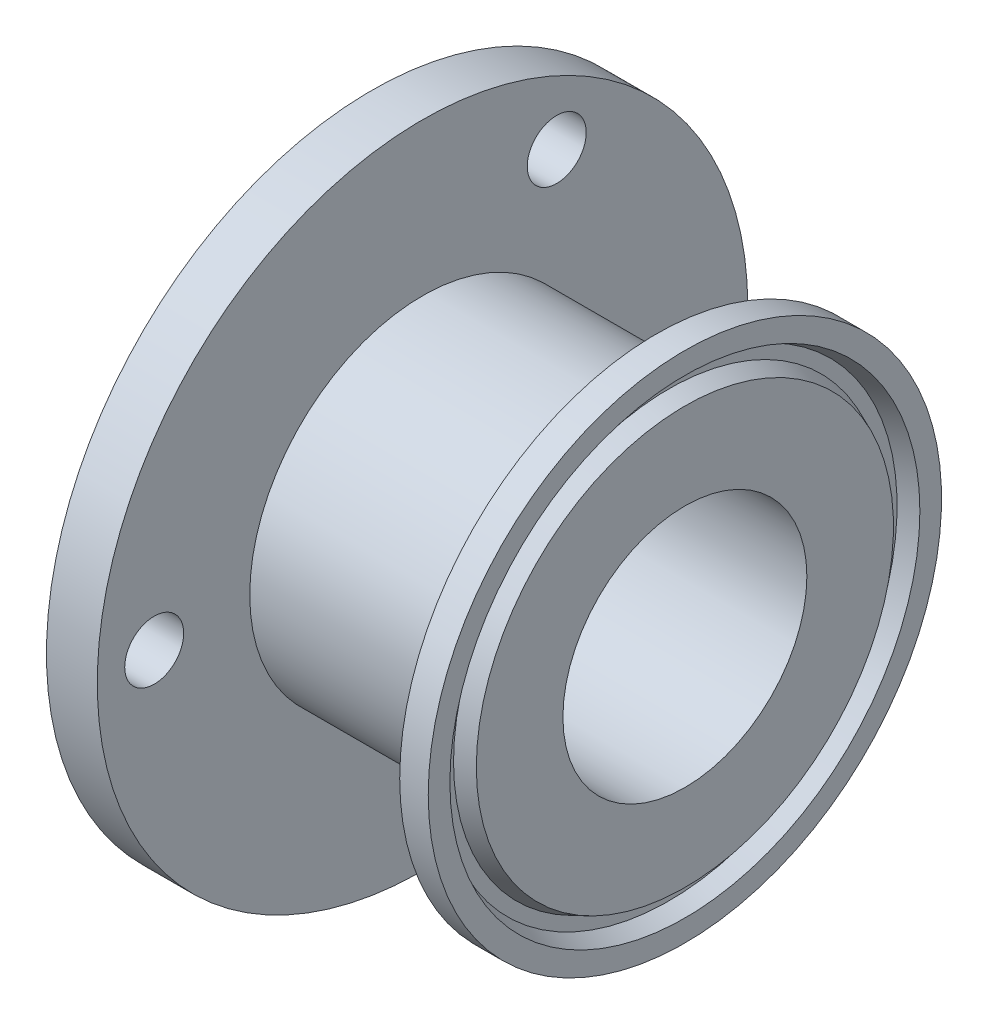
ISO-10303-21;
HEADER;
FILE_DESCRIPTION(('STEP AP214'),'2;1');
FILE_NAME('part.step','',(''),(''),'','','');
FILE_SCHEMA(('AUTOMOTIVE_DESIGN { 1 0 10303 214 1 1 1 1 }'));
ENDSEC;
DATA;
#1=APPLICATION_CONTEXT('core data for automotive mechanical design processes');
#2=APPLICATION_PROTOCOL_DEFINITION('international standard','automotive_design',2000,#1);
#3=PRODUCT_CONTEXT('',#1,'mechanical');
#4=PRODUCT('Part','Part','',(#3));
#5=PRODUCT_RELATED_PRODUCT_CATEGORY('part','',(#4));
#6=PRODUCT_DEFINITION_FORMATION('','',#4);
#7=PRODUCT_DEFINITION_CONTEXT('part definition',#1,'design');
#8=PRODUCT_DEFINITION('design','',#6,#7);
#9=PRODUCT_DEFINITION_SHAPE('','',#8);
#10=(LENGTH_UNIT() NAMED_UNIT(*) SI_UNIT(.MILLI.,.METRE.));
#11=(NAMED_UNIT(*) PLANE_ANGLE_UNIT() SI_UNIT($,.RADIAN.));
#12=(NAMED_UNIT(*) SI_UNIT($,.STERADIAN.) SOLID_ANGLE_UNIT());
#13=UNCERTAINTY_MEASURE_WITH_UNIT(LENGTH_MEASURE(1.E-05),#10,'distance_accuracy_value','');
#14=(GEOMETRIC_REPRESENTATION_CONTEXT(3) GLOBAL_UNCERTAINTY_ASSIGNED_CONTEXT((#13)) GLOBAL_UNIT_ASSIGNED_CONTEXT((#10,
#11,#12)) REPRESENTATION_CONTEXT('',''));
#15=CARTESIAN_POINT('',(0.,0.,0.));
#16=DIRECTION('',(0.,0.,1.));
#17=DIRECTION('',(1.,0.,0.));
#18=AXIS2_PLACEMENT_3D('',#15,#16,#17);
#19=CARTESIAN_POINT('',(-10.4047272163481,34.,0.));
#20=DIRECTION('',(-1.,0.,0.));
#21=DIRECTION('',(0.,0.,1.));
#22=AXIS2_PLACEMENT_3D('',#19,#20,#21);
#23=PLANE('',#22);
#24=CARTESIAN_POINT('',(-10.4047272163481,-22.8630706604579,-13.1999999990536));
#25=DIRECTION('',(-1.,0.,0.));
#26=DIRECTION('',(0.,0.,1.));
#27=AXIS2_PLACEMENT_3D('',#24,#25,#26);
#28=CIRCLE('',#27,2.9);
#29=CARTESIAN_POINT('',(-10.4047272163481,-22.8630706604579,-10.2999999990536));
#30=VERTEX_POINT('',#29);
#31=EDGE_CURVE('E90',#30,#30,#28,.F.);
#32=ORIENTED_EDGE('',*,*,#31,.F.);
#33=EDGE_LOOP('',(#32));
#34=FACE_BOUND('',#33,.T.);
#35=CARTESIAN_POINT('',(-10.4047272163481,22.8630706593604,-13.2000000009425));
#36=DIRECTION('',(-1.,0.,0.));
#37=DIRECTION('',(0.,0.,1.));
#38=AXIS2_PLACEMENT_3D('',#35,#36,#37);
#39=CIRCLE('',#38,2.9);
#40=CARTESIAN_POINT('',(-10.4047272163481,22.8630706593604,-10.3000000009425));
#41=VERTEX_POINT('',#40);
#42=EDGE_CURVE('E84',#41,#41,#39,.F.);
#43=ORIENTED_EDGE('',*,*,#42,.F.);
#44=EDGE_LOOP('',(#43));
#45=FACE_BOUND('',#44,.T.);
#46=CARTESIAN_POINT('',(-10.4047272163481,0.,0.));
#47=DIRECTION('',(-1.,0.,0.));
#48=DIRECTION('',(0.,0.,1.));
#49=AXIS2_PLACEMENT_3D('',#46,#47,#48);
#50=CIRCLE('',#49,17.);
#51=CARTESIAN_POINT('',(-10.4047272163481,0.,17.));
#52=VERTEX_POINT('',#51);
#53=EDGE_CURVE('E74',#52,#52,#50,.T.);
#54=ORIENTED_EDGE('',*,*,#53,.T.);
#55=EDGE_LOOP('',(#54));
#56=FACE_BOUND('',#55,.T.);
#57=CARTESIAN_POINT('',(-10.4047272163481,1.08713038571295E-09,26.4000000000021));
#58=DIRECTION('',(-1.,0.,0.));
#59=DIRECTION('',(0.,0.,1.));
#60=AXIS2_PLACEMENT_3D('',#57,#58,#59);
#61=CIRCLE('',#60,2.9);
#62=CARTESIAN_POINT('',(-10.4047272163481,1.08713038571295E-09,29.3000000000021));
#63=VERTEX_POINT('',#62);
#64=EDGE_CURVE('E80',#63,#63,#61,.F.);
#65=ORIENTED_EDGE('',*,*,#64,.F.);
#66=EDGE_LOOP('',(#65));
#67=FACE_BOUND('',#66,.T.);
#68=CARTESIAN_POINT('',(-10.4047272163481,0.,0.));
#69=DIRECTION('',(1.,0.,0.));
#70=DIRECTION('',(0.,0.,-1.));
#71=AXIS2_PLACEMENT_3D('',#68,#69,#70);
#72=CIRCLE('',#71,32.);
#73=CARTESIAN_POINT('',(-10.4047272163481,0.,-32.));
#74=VERTEX_POINT('',#73);
#75=EDGE_CURVE('E99',#74,#74,#72,.T.);
#76=ORIENTED_EDGE('',*,*,#75,.T.);
#77=EDGE_LOOP('',(#76));
#78=FACE_BOUND('',#77,.T.);
#79=ADVANCED_FACE('F39',(#34,#45,#56,#67,#78),#23,.F.);
#80=CARTESIAN_POINT('',(-15.4047272163481,12.,0.));
#81=DIRECTION('',(1.,0.,0.));
#82=DIRECTION('',(0.,0.,-1.));
#83=AXIS2_PLACEMENT_3D('',#80,#81,#82);
#84=PLANE('',#83);
#85=CARTESIAN_POINT('',(-15.4047272163481,0.,0.));
#86=DIRECTION('',(-1.,0.,0.));
#87=DIRECTION('',(0.,0.,1.));
#88=AXIS2_PLACEMENT_3D('',#85,#86,#87);
#89=CIRCLE('',#88,12.);
#90=CARTESIAN_POINT('',(-15.4047272163481,0.,12.));
#91=VERTEX_POINT('',#90);
#92=EDGE_CURVE('E77',#91,#91,#89,.T.);
#93=ORIENTED_EDGE('',*,*,#92,.F.);
#94=EDGE_LOOP('',(#93));
#95=FACE_BOUND('',#94,.T.);
#96=CARTESIAN_POINT('',(-15.4047272163481,1.08713038571295E-09,26.4000000000021));
#97=DIRECTION('',(-1.,0.,0.));
#98=DIRECTION('',(0.,0.,1.));
#99=AXIS2_PLACEMENT_3D('',#96,#97,#98);
#100=CIRCLE('',#99,2.9);
#101=CARTESIAN_POINT('',(-15.4047272163481,1.08713038571295E-09,29.3000000000021));
#102=VERTEX_POINT('',#101);
#103=EDGE_CURVE('E81',#102,#102,#100,.T.);
#104=ORIENTED_EDGE('',*,*,#103,.F.);
#105=EDGE_LOOP('',(#104));
#106=FACE_BOUND('',#105,.T.);
#107=CARTESIAN_POINT('',(-15.4047272163481,22.8630706593604,-13.2000000009425));
#108=DIRECTION('',(-1.,0.,0.));
#109=DIRECTION('',(0.,0.,1.));
#110=AXIS2_PLACEMENT_3D('',#107,#108,#109);
#111=CIRCLE('',#110,2.9);
#112=CARTESIAN_POINT('',(-15.4047272163481,22.8630706593604,-10.3000000009425));
#113=VERTEX_POINT('',#112);
#114=EDGE_CURVE('E87',#113,#113,#111,.T.);
#115=ORIENTED_EDGE('',*,*,#114,.F.);
#116=EDGE_LOOP('',(#115));
#117=FACE_BOUND('',#116,.T.);
#118=CARTESIAN_POINT('',(-15.4047272163481,-22.8630706604579,-13.1999999990536));
#119=DIRECTION('',(-1.,0.,0.));
#120=DIRECTION('',(0.,0.,1.));
#121=AXIS2_PLACEMENT_3D('',#118,#119,#120);
#122=CIRCLE('',#121,2.9);
#123=CARTESIAN_POINT('',(-15.4047272163481,-22.8630706604579,-10.2999999990536));
#124=VERTEX_POINT('',#123);
#125=EDGE_CURVE('E93',#124,#124,#122,.T.);
#126=ORIENTED_EDGE('',*,*,#125,.F.);
#127=EDGE_LOOP('',(#126));
#128=FACE_BOUND('',#127,.T.);
#129=CARTESIAN_POINT('',(-15.4047272163481,0.,0.));
#130=DIRECTION('',(1.,0.,0.));
#131=DIRECTION('',(0.,0.,-1.));
#132=AXIS2_PLACEMENT_3D('',#129,#130,#131);
#133=CIRCLE('',#132,32.);
#134=CARTESIAN_POINT('',(-15.4047272163481,0.,-32.));
#135=VERTEX_POINT('',#134);
#136=EDGE_CURVE('E96',#135,#135,#133,.T.);
#137=ORIENTED_EDGE('',*,*,#136,.F.);
#138=EDGE_LOOP('',(#137));
#139=FACE_BOUND('',#138,.T.);
#140=ADVANCED_FACE('F108',(#95,#106,#117,#128,#139),#84,.F.);
#141=CARTESIAN_POINT('',(0.,0.,0.));
#142=DIRECTION('',(-1.,0.,0.));
#143=DIRECTION('',(0.,0.,1.));
#144=AXIS2_PLACEMENT_3D('',#141,#142,#143);
#145=CYLINDRICAL_SURFACE('',#144,12.);
#146=CARTESIAN_POINT('',(15.4047272163481,0.,0.));
#147=DIRECTION('',(-1.,0.,0.));
#148=DIRECTION('',(0.,0.,1.));
#149=AXIS2_PLACEMENT_3D('',#146,#147,#148);
#150=CIRCLE('',#149,12.);
#151=CARTESIAN_POINT('',(15.4047272163481,0.,12.));
#152=VERTEX_POINT('',#151);
#153=EDGE_CURVE('E11',#152,#152,#150,.T.);
#154=ORIENTED_EDGE('',*,*,#153,.F.);
#155=EDGE_LOOP('',(#154));
#156=FACE_BOUND('',#155,.T.);
#157=ORIENTED_EDGE('',*,*,#92,.T.);
#158=EDGE_LOOP('',(#157));
#159=FACE_BOUND('',#158,.T.);
#160=ADVANCED_FACE('F41',(#156,#159),#145,.F.);
#161=CARTESIAN_POINT('',(15.4047272163481,20.5186,0.));
#162=DIRECTION('',(-1.,0.,0.));
#163=DIRECTION('',(0.,0.,1.));
#164=AXIS2_PLACEMENT_3D('',#161,#162,#163);
#165=PLANE('',#164);
#166=CARTESIAN_POINT('',(15.4047272163481,0.,0.));
#167=DIRECTION('',(-1.,0.,0.));
#168=DIRECTION('',(0.,0.,1.));
#169=AXIS2_PLACEMENT_3D('',#166,#167,#168);
#170=CIRCLE('',#169,20.5186);
#171=CARTESIAN_POINT('',(15.4047272163481,0.,20.5186));
#172=VERTEX_POINT('',#171);
#173=EDGE_CURVE('E46',#172,#172,#170,.T.);
#174=ORIENTED_EDGE('',*,*,#173,.F.);
#175=EDGE_LOOP('',(#174));
#176=FACE_BOUND('',#175,.T.);
#177=ORIENTED_EDGE('',*,*,#153,.T.);
#178=EDGE_LOOP('',(#177));
#179=FACE_BOUND('',#178,.T.);
#180=ADVANCED_FACE('F116',(#176,#179),#165,.F.);
#181=CARTESIAN_POINT('',(15.4047272163481,0.,0.));
#182=DIRECTION('',(-1.,0.,0.));
#183=DIRECTION('',(0.,0.,1.));
#184=AXIS2_PLACEMENT_3D('',#181,#182,#183);
#185=CONICAL_SURFACE('',#184,20.5186,0.401425727958695);
#186=CARTESIAN_POINT('',(13.8299272163481,0.,0.));
#187=DIRECTION('',(-1.,0.,0.));
#188=DIRECTION('',(0.,0.,1.));
#189=AXIS2_PLACEMENT_3D('',#186,#187,#188);
#190=CIRCLE('',#189,21.1870629405669);
#191=CARTESIAN_POINT('',(13.8299272163481,0.,21.1870629405669));
#192=VERTEX_POINT('',#191);
#193=EDGE_CURVE('E50',#192,#192,#190,.T.);
#194=ORIENTED_EDGE('',*,*,#193,.F.);
#195=EDGE_LOOP('',(#194));
#196=FACE_BOUND('',#195,.T.);
#197=ORIENTED_EDGE('',*,*,#173,.T.);
#198=EDGE_LOOP('',(#197));
#199=FACE_BOUND('',#198,.T.);
#200=ADVANCED_FACE('F153',(#196,#199),#185,.T.);
#201=CARTESIAN_POINT('',(13.8299272163481,22.4501370594331,0.));
#202=DIRECTION('',(-1.,0.,0.));
#203=DIRECTION('',(0.,0.,1.));
#204=AXIS2_PLACEMENT_3D('',#201,#202,#203);
#205=PLANE('',#204);
#206=CARTESIAN_POINT('',(13.8299272163481,0.,0.));
#207=DIRECTION('',(-1.,0.,0.));
#208=DIRECTION('',(0.,0.,1.));
#209=AXIS2_PLACEMENT_3D('',#206,#207,#208);
#210=CIRCLE('',#209,22.4501370594331);
#211=CARTESIAN_POINT('',(13.8299272163481,0.,22.4501370594331));
#212=VERTEX_POINT('',#211);
#213=EDGE_CURVE('E54',#212,#212,#210,.T.);
#214=ORIENTED_EDGE('',*,*,#213,.F.);
#215=EDGE_LOOP('',(#214));
#216=FACE_BOUND('',#215,.T.);
#217=ORIENTED_EDGE('',*,*,#193,.T.);
#218=EDGE_LOOP('',(#217));
#219=FACE_BOUND('',#218,.T.);
#220=ADVANCED_FACE('F149',(#216,#219),#205,.F.);
#221=CARTESIAN_POINT('',(13.8299272163481,0.,0.));
#222=DIRECTION('',(1.,0.,0.));
#223=DIRECTION('',(0.,0.,-1.));
#224=AXIS2_PLACEMENT_3D('',#221,#222,#223);
#225=CONICAL_SURFACE('',#224,22.4501370594331,0.401425727958695);
#226=CARTESIAN_POINT('',(15.4047272163481,0.,0.));
#227=DIRECTION('',(-1.,0.,0.));
#228=DIRECTION('',(0.,0.,1.));
#229=AXIS2_PLACEMENT_3D('',#226,#227,#228);
#230=CIRCLE('',#229,23.1186);
#231=CARTESIAN_POINT('',(15.4047272163481,0.,23.1186));
#232=VERTEX_POINT('',#231);
#233=EDGE_CURVE('E59',#232,#232,#230,.T.);
#234=ORIENTED_EDGE('',*,*,#233,.F.);
#235=EDGE_LOOP('',(#234));
#236=FACE_BOUND('',#235,.T.);
#237=ORIENTED_EDGE('',*,*,#213,.T.);
#238=EDGE_LOOP('',(#237));
#239=FACE_BOUND('',#238,.T.);
#240=ADVANCED_FACE('F145',(#236,#239),#225,.F.);
#241=CARTESIAN_POINT('',(15.4047272163481,25.25,0.));
#242=DIRECTION('',(-1.,0.,0.));
#243=DIRECTION('',(0.,0.,1.));
#244=AXIS2_PLACEMENT_3D('',#241,#242,#243);
#245=PLANE('',#244);
#246=CARTESIAN_POINT('',(15.4047272163481,0.,0.));
#247=DIRECTION('',(-1.,0.,0.));
#248=DIRECTION('',(0.,0.,1.));
#249=AXIS2_PLACEMENT_3D('',#246,#247,#248);
#250=CIRCLE('',#249,25.25);
#251=CARTESIAN_POINT('',(15.4047272163481,0.,25.25));
#252=VERTEX_POINT('',#251);
#253=EDGE_CURVE('E62',#252,#252,#250,.T.);
#254=ORIENTED_EDGE('',*,*,#253,.F.);
#255=EDGE_LOOP('',(#254));
#256=FACE_BOUND('',#255,.T.);
#257=ORIENTED_EDGE('',*,*,#233,.T.);
#258=EDGE_LOOP('',(#257));
#259=FACE_BOUND('',#258,.T.);
#260=ADVANCED_FACE('F141',(#256,#259),#245,.F.);
#261=CARTESIAN_POINT('',(0.,0.,0.));
#262=DIRECTION('',(-1.,0.,0.));
#263=DIRECTION('',(0.,0.,1.));
#264=AXIS2_PLACEMENT_3D('',#261,#262,#263);
#265=CYLINDRICAL_SURFACE('',#264,25.25);
#266=CARTESIAN_POINT('',(12.5980272163481,0.,0.));
#267=DIRECTION('',(-1.,0.,0.));
#268=DIRECTION('',(0.,0.,1.));
#269=AXIS2_PLACEMENT_3D('',#266,#267,#268);
#270=CIRCLE('',#269,25.25);
#271=CARTESIAN_POINT('',(12.5980272163481,0.,25.25));
#272=VERTEX_POINT('',#271);
#273=EDGE_CURVE('E65',#272,#272,#270,.T.);
#274=ORIENTED_EDGE('',*,*,#273,.F.);
#275=EDGE_LOOP('',(#274));
#276=FACE_BOUND('',#275,.T.);
#277=ORIENTED_EDGE('',*,*,#253,.T.);
#278=EDGE_LOOP('',(#277));
#279=FACE_BOUND('',#278,.T.);
#280=ADVANCED_FACE('F137',(#276,#279),#265,.T.);
#281=CARTESIAN_POINT('',(12.5980272163481,0.,0.));
#282=DIRECTION('',(1.,0.,0.));
#283=DIRECTION('',(0.,0.,-1.));
#284=AXIS2_PLACEMENT_3D('',#281,#282,#283);
#285=CONICAL_SURFACE('',#284,25.25,1.22173047639604);
#286=CARTESIAN_POINT('',(9.86900423303653,0.,0.));
#287=DIRECTION('',(-1.,0.,0.));
#288=DIRECTION('',(0.,0.,1.));
#289=AXIS2_PLACEMENT_3D('',#286,#287,#288);
#290=CIRCLE('',#289,17.7520709761788);
#291=CARTESIAN_POINT('',(9.86900423303653,0.,17.7520709761788));
#292=VERTEX_POINT('',#291);
#293=EDGE_CURVE('E68',#292,#292,#290,.T.);
#294=ORIENTED_EDGE('',*,*,#293,.F.);
#295=EDGE_LOOP('',(#294));
#296=FACE_BOUND('',#295,.T.);
#297=ORIENTED_EDGE('',*,*,#273,.T.);
#298=EDGE_LOOP('',(#297));
#299=FACE_BOUND('',#298,.T.);
#300=ADVANCED_FACE('F133',(#296,#299),#285,.T.);
#301=CARTESIAN_POINT('',(8.79493556747824,0.,0.));
#302=DIRECTION('',(-1.,0.,0.));
#303=DIRECTION('',(0.,0.,1.));
#304=AXIS2_PLACEMENT_3D('',#301,#302,#303);
#305=TOROIDAL_SURFACE('',#304,18.143,1.143);
#306=CARTESIAN_POINT('',(8.79493556747824,0.,0.));
#307=DIRECTION('',(-1.,0.,0.));
#308=DIRECTION('',(0.,0.,1.));
#309=AXIS2_PLACEMENT_3D('',#306,#307,#308);
#310=CIRCLE('',#309,17.);
#311=CARTESIAN_POINT('',(8.79493556747824,0.,17.));
#312=VERTEX_POINT('',#311);
#313=EDGE_CURVE('E71',#312,#312,#310,.T.);
#314=ORIENTED_EDGE('',*,*,#313,.F.);
#315=EDGE_LOOP('',(#314));
#316=FACE_BOUND('',#315,.T.);
#317=ORIENTED_EDGE('',*,*,#293,.T.);
#318=EDGE_LOOP('',(#317));
#319=FACE_BOUND('',#318,.T.);
#320=ADVANCED_FACE('F129',(#316,#319),#305,.F.);
#321=CARTESIAN_POINT('',(0.,0.,0.));
#322=DIRECTION('',(-1.,0.,0.));
#323=DIRECTION('',(0.,0.,1.));
#324=AXIS2_PLACEMENT_3D('',#321,#322,#323);
#325=CYLINDRICAL_SURFACE('',#324,17.);
#326=ORIENTED_EDGE('',*,*,#53,.F.);
#327=EDGE_LOOP('',(#326));
#328=FACE_BOUND('',#327,.T.);
#329=ORIENTED_EDGE('',*,*,#313,.T.);
#330=EDGE_LOOP('',(#329));
#331=FACE_BOUND('',#330,.T.);
#332=ADVANCED_FACE('F126',(#328,#331),#325,.T.);
#333=CARTESIAN_POINT('',(-15.4047272163481,1.08713038571295E-09,26.4000000000021));
#334=DIRECTION('',(-1.,0.,0.));
#335=DIRECTION('',(0.,0.,1.));
#336=AXIS2_PLACEMENT_3D('',#333,#334,#335);
#337=CYLINDRICAL_SURFACE('',#336,2.9);
#338=ORIENTED_EDGE('',*,*,#64,.T.);
#339=EDGE_LOOP('',(#338));
#340=FACE_BOUND('',#339,.T.);
#341=ORIENTED_EDGE('',*,*,#103,.T.);
#342=EDGE_LOOP('',(#341));
#343=FACE_BOUND('',#342,.T.);
#344=ADVANCED_FACE('F123',(#340,#343),#337,.F.);
#345=CARTESIAN_POINT('',(-15.4047272163481,22.8630706593604,-13.2000000009425));
#346=DIRECTION('',(-1.,0.,0.));
#347=DIRECTION('',(0.,0.,1.));
#348=AXIS2_PLACEMENT_3D('',#345,#346,#347);
#349=CYLINDRICAL_SURFACE('',#348,2.9);
#350=ORIENTED_EDGE('',*,*,#42,.T.);
#351=EDGE_LOOP('',(#350));
#352=FACE_BOUND('',#351,.T.);
#353=ORIENTED_EDGE('',*,*,#114,.T.);
#354=EDGE_LOOP('',(#353));
#355=FACE_BOUND('',#354,.T.);
#356=ADVANCED_FACE('F202',(#352,#355),#349,.F.);
#357=CARTESIAN_POINT('',(-15.4047272163481,-22.8630706604579,-13.1999999990536));
#358=DIRECTION('',(-1.,0.,0.));
#359=DIRECTION('',(0.,0.,1.));
#360=AXIS2_PLACEMENT_3D('',#357,#358,#359);
#361=CYLINDRICAL_SURFACE('',#360,2.9);
#362=ORIENTED_EDGE('',*,*,#31,.T.);
#363=EDGE_LOOP('',(#362));
#364=FACE_BOUND('',#363,.T.);
#365=ORIENTED_EDGE('',*,*,#125,.T.);
#366=EDGE_LOOP('',(#365));
#367=FACE_BOUND('',#366,.T.);
#368=ADVANCED_FACE('F208',(#364,#367),#361,.F.);
#369=CARTESIAN_POINT('',(-15.4047272163481,0.,0.));
#370=DIRECTION('',(1.,0.,0.));
#371=DIRECTION('',(0.,0.,-1.));
#372=AXIS2_PLACEMENT_3D('',#369,#370,#371);
#373=CYLINDRICAL_SURFACE('',#372,32.);
#374=ORIENTED_EDGE('',*,*,#136,.T.);
#375=EDGE_LOOP('',(#374));
#376=FACE_BOUND('',#375,.T.);
#377=ORIENTED_EDGE('',*,*,#75,.F.);
#378=EDGE_LOOP('',(#377));
#379=FACE_BOUND('',#378,.T.);
#380=ADVANCED_FACE('F105',(#376,#379),#373,.T.);
#381=CLOSED_SHELL('',(#79,#140,#160,#180,#200,#220,#240,#260,#280,#300,#320,#332,#344,#356,#368,#380));
#382=MANIFOLD_SOLID_BREP('B2',#381);
#383=ADVANCED_BREP_SHAPE_REPRESENTATION('',(#18,#382),#14);
#384=SHAPE_DEFINITION_REPRESENTATION(#9,#383);
ENDSEC;
END-ISO-10303-21;
